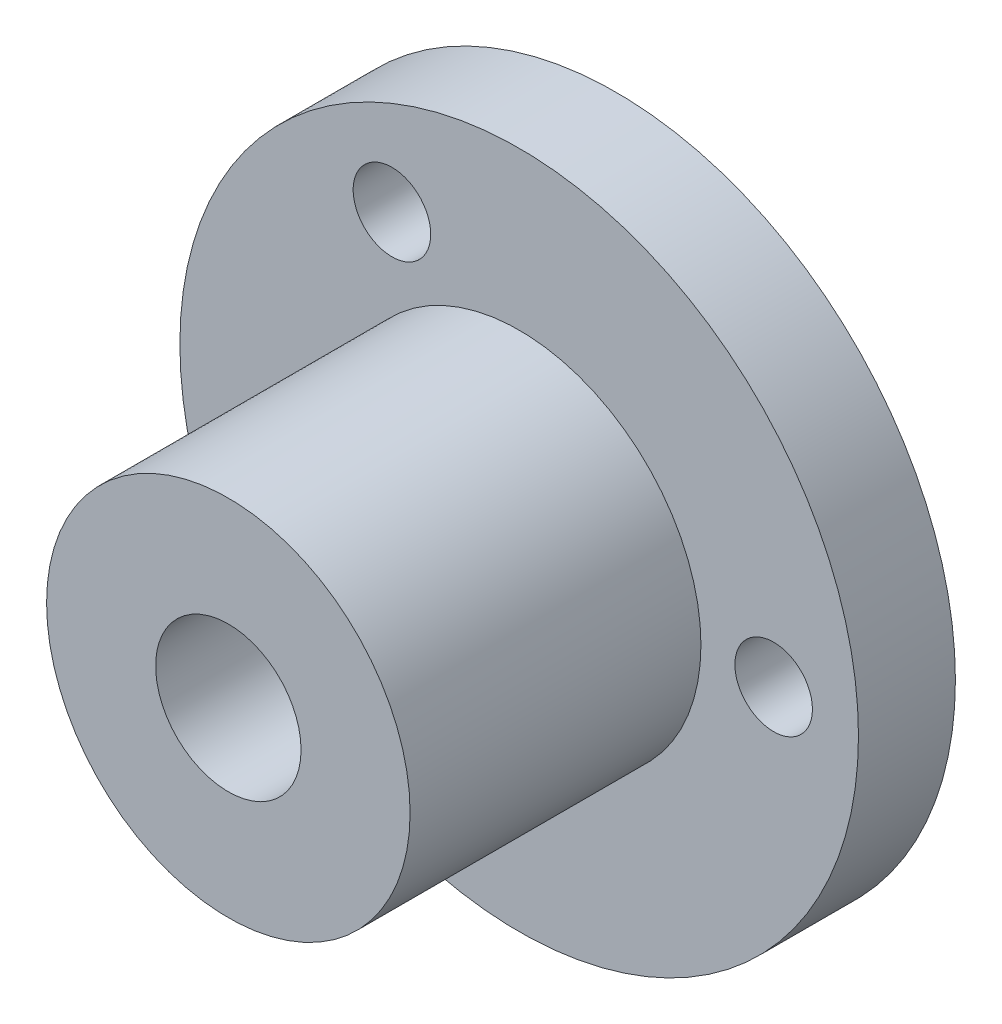
ISO-10303-21;
HEADER;
FILE_DESCRIPTION(('STEP AP214'),'2;1');
FILE_NAME('part.step','',(''),(''),'','','');
FILE_SCHEMA(('AUTOMOTIVE_DESIGN { 1 0 10303 214 1 1 1 1 }'));
ENDSEC;
DATA;
#1=APPLICATION_CONTEXT('core data for automotive mechanical design processes');
#2=APPLICATION_PROTOCOL_DEFINITION('international standard','automotive_design',2000,#1);
#3=PRODUCT_CONTEXT('',#1,'mechanical');
#4=PRODUCT('Part','Part','',(#3));
#5=PRODUCT_RELATED_PRODUCT_CATEGORY('part','',(#4));
#6=PRODUCT_DEFINITION_FORMATION('','',#4);
#7=PRODUCT_DEFINITION_CONTEXT('part definition',#1,'design');
#8=PRODUCT_DEFINITION('design','',#6,#7);
#9=PRODUCT_DEFINITION_SHAPE('','',#8);
#10=(LENGTH_UNIT() NAMED_UNIT(*) SI_UNIT(.MILLI.,.METRE.));
#11=(NAMED_UNIT(*) PLANE_ANGLE_UNIT() SI_UNIT($,.RADIAN.));
#12=(NAMED_UNIT(*) SI_UNIT($,.STERADIAN.) SOLID_ANGLE_UNIT());
#13=UNCERTAINTY_MEASURE_WITH_UNIT(LENGTH_MEASURE(1.E-05),#10,'distance_accuracy_value','');
#14=(GEOMETRIC_REPRESENTATION_CONTEXT(3) GLOBAL_UNCERTAINTY_ASSIGNED_CONTEXT((#13)) GLOBAL_UNIT_ASSIGNED_CONTEXT((#10,
#11,#12)) REPRESENTATION_CONTEXT('',''));
#15=CARTESIAN_POINT('',(0.,0.,0.));
#16=DIRECTION('',(0.,0.,1.));
#17=DIRECTION('',(1.,0.,0.));
#18=AXIS2_PLACEMENT_3D('',#15,#16,#17);
#19=CARTESIAN_POINT('',(0.,0.,4.));
#20=DIRECTION('',(0.,0.,-1.));
#21=DIRECTION('',(-1.,0.,0.));
#22=AXIS2_PLACEMENT_3D('',#19,#20,#21);
#23=CYLINDRICAL_SURFACE('',#22,3.);
#24=CARTESIAN_POINT('',(0.,0.,0.));
#25=DIRECTION('',(0.,0.,1.));
#26=DIRECTION('',(1.,0.,0.));
#27=AXIS2_PLACEMENT_3D('',#24,#25,#26);
#28=CIRCLE('',#27,3.);
#29=CARTESIAN_POINT('',(3.,0.,0.));
#30=VERTEX_POINT('',#29);
#31=EDGE_CURVE('E66',#30,#30,#28,.T.);
#32=ORIENTED_EDGE('',*,*,#31,.F.);
#33=EDGE_LOOP('',(#32));
#34=FACE_BOUND('',#33,.T.);
#35=CARTESIAN_POINT('',(0.,0.,16.));
#36=DIRECTION('',(0.,0.,1.));
#37=DIRECTION('',(1.,0.,0.));
#38=AXIS2_PLACEMENT_3D('',#35,#36,#37);
#39=CIRCLE('',#38,3.);
#40=CARTESIAN_POINT('',(3.,0.,16.));
#41=VERTEX_POINT('',#40);
#42=EDGE_CURVE('E154',#41,#41,#39,.T.);
#43=ORIENTED_EDGE('',*,*,#42,.T.);
#44=EDGE_LOOP('',(#43));
#45=FACE_BOUND('',#44,.T.);
#46=ADVANCED_FACE('F31',(#34,#45),#23,.F.);
#47=CARTESIAN_POINT('',(-5.25000000000004,9.09326673973658,4.));
#48=DIRECTION('',(0.,0.,-1.));
#49=DIRECTION('',(-1.,0.,0.));
#50=AXIS2_PLACEMENT_3D('',#47,#48,#49);
#51=CYLINDRICAL_SURFACE('',#50,1.6);
#52=CARTESIAN_POINT('',(-5.25000000000004,9.09326673973658,4.));
#53=DIRECTION('',(0.,0.,1.));
#54=DIRECTION('',(1.,0.,0.));
#55=AXIS2_PLACEMENT_3D('',#52,#53,#54);
#56=CIRCLE('',#55,1.6);
#57=CARTESIAN_POINT('',(-3.65000000000004,9.09326673973658,4.));
#58=VERTEX_POINT('',#57);
#59=EDGE_CURVE('E44',#58,#58,#56,.T.);
#60=ORIENTED_EDGE('',*,*,#59,.T.);
#61=EDGE_LOOP('',(#60));
#62=FACE_BOUND('',#61,.T.);
#63=CARTESIAN_POINT('',(-5.25000000000004,9.09326673973658,0.));
#64=DIRECTION('',(0.,0.,1.));
#65=DIRECTION('',(1.,0.,0.));
#66=AXIS2_PLACEMENT_3D('',#63,#64,#65);
#67=CIRCLE('',#66,1.6);
#68=CARTESIAN_POINT('',(-3.65000000000004,9.09326673973658,0.));
#69=VERTEX_POINT('',#68);
#70=EDGE_CURVE('E64',#69,#69,#67,.T.);
#71=ORIENTED_EDGE('',*,*,#70,.F.);
#72=EDGE_LOOP('',(#71));
#73=FACE_BOUND('',#72,.T.);
#74=ADVANCED_FACE('F93',(#62,#73),#51,.F.);
#75=CARTESIAN_POINT('',(-5.25000000000004,-9.09326673973658,4.));
#76=DIRECTION('',(0.,0.,-1.));
#77=DIRECTION('',(-1.,0.,0.));
#78=AXIS2_PLACEMENT_3D('',#75,#76,#77);
#79=CYLINDRICAL_SURFACE('',#78,1.6);
#80=CARTESIAN_POINT('',(-5.25000000000004,-9.09326673973658,4.));
#81=DIRECTION('',(0.,0.,1.));
#82=DIRECTION('',(1.,0.,0.));
#83=AXIS2_PLACEMENT_3D('',#80,#81,#82);
#84=CIRCLE('',#83,1.6);
#85=CARTESIAN_POINT('',(-3.65000000000004,-9.09326673973658,4.));
#86=VERTEX_POINT('',#85);
#87=EDGE_CURVE('E53',#86,#86,#84,.T.);
#88=ORIENTED_EDGE('',*,*,#87,.T.);
#89=EDGE_LOOP('',(#88));
#90=FACE_BOUND('',#89,.T.);
#91=CARTESIAN_POINT('',(-5.25000000000004,-9.09326673973658,0.));
#92=DIRECTION('',(0.,0.,1.));
#93=DIRECTION('',(1.,0.,0.));
#94=AXIS2_PLACEMENT_3D('',#91,#92,#93);
#95=CIRCLE('',#94,1.6);
#96=CARTESIAN_POINT('',(-3.65000000000004,-9.09326673973658,0.));
#97=VERTEX_POINT('',#96);
#98=EDGE_CURVE('E61',#97,#97,#95,.T.);
#99=ORIENTED_EDGE('',*,*,#98,.F.);
#100=EDGE_LOOP('',(#99));
#101=FACE_BOUND('',#100,.T.);
#102=ADVANCED_FACE('F99',(#90,#101),#79,.F.);
#103=CARTESIAN_POINT('',(10.5,0.,4.));
#104=DIRECTION('',(0.,0.,-1.));
#105=DIRECTION('',(-1.,0.,0.));
#106=AXIS2_PLACEMENT_3D('',#103,#104,#105);
#107=CYLINDRICAL_SURFACE('',#106,1.6);
#108=CARTESIAN_POINT('',(10.5,0.,4.));
#109=DIRECTION('',(0.,0.,1.));
#110=DIRECTION('',(1.,0.,0.));
#111=AXIS2_PLACEMENT_3D('',#108,#109,#110);
#112=CIRCLE('',#111,1.6);
#113=CARTESIAN_POINT('',(12.1,0.,4.));
#114=VERTEX_POINT('',#113);
#115=EDGE_CURVE('E50',#114,#114,#112,.T.);
#116=ORIENTED_EDGE('',*,*,#115,.T.);
#117=EDGE_LOOP('',(#116));
#118=FACE_BOUND('',#117,.T.);
#119=CARTESIAN_POINT('',(10.5,0.,0.));
#120=DIRECTION('',(0.,0.,1.));
#121=DIRECTION('',(1.,0.,0.));
#122=AXIS2_PLACEMENT_3D('',#119,#120,#121);
#123=CIRCLE('',#122,1.6);
#124=CARTESIAN_POINT('',(12.1,0.,0.));
#125=VERTEX_POINT('',#124);
#126=EDGE_CURVE('E58',#125,#125,#123,.T.);
#127=ORIENTED_EDGE('',*,*,#126,.F.);
#128=EDGE_LOOP('',(#127));
#129=FACE_BOUND('',#128,.T.);
#130=ADVANCED_FACE('F33',(#118,#129),#107,.F.);
#131=CARTESIAN_POINT('',(0.,0.,4.));
#132=DIRECTION('',(0.,0.,-1.));
#133=DIRECTION('',(-1.,0.,0.));
#134=AXIS2_PLACEMENT_3D('',#131,#132,#133);
#135=CYLINDRICAL_SURFACE('',#134,14.);
#136=CARTESIAN_POINT('',(0.,0.,4.));
#137=DIRECTION('',(0.,0.,1.));
#138=DIRECTION('',(1.,0.,0.));
#139=AXIS2_PLACEMENT_3D('',#136,#137,#138);
#140=CIRCLE('',#139,14.);
#141=CARTESIAN_POINT('',(14.,0.,4.));
#142=VERTEX_POINT('',#141);
#143=EDGE_CURVE('E39',#142,#142,#140,.T.);
#144=ORIENTED_EDGE('',*,*,#143,.F.);
#145=EDGE_LOOP('',(#144));
#146=FACE_BOUND('',#145,.T.);
#147=CARTESIAN_POINT('',(0.,0.,0.));
#148=DIRECTION('',(0.,0.,1.));
#149=DIRECTION('',(1.,0.,0.));
#150=AXIS2_PLACEMENT_3D('',#147,#148,#149);
#151=CIRCLE('',#150,14.);
#152=CARTESIAN_POINT('',(14.,0.,0.));
#153=VERTEX_POINT('',#152);
#154=EDGE_CURVE('E35',#153,#153,#151,.T.);
#155=ORIENTED_EDGE('',*,*,#154,.T.);
#156=EDGE_LOOP('',(#155));
#157=FACE_BOUND('',#156,.T.);
#158=ADVANCED_FACE('F73',(#146,#157),#135,.T.);
#159=CARTESIAN_POINT('',(0.,0.,4.));
#160=DIRECTION('',(0.,0.,1.));
#161=DIRECTION('',(1.,0.,0.));
#162=AXIS2_PLACEMENT_3D('',#159,#160,#161);
#163=PLANE('',#162);
#164=CARTESIAN_POINT('',(0.,0.,4.));
#165=DIRECTION('',(0.,0.,1.));
#166=DIRECTION('',(1.,0.,0.));
#167=AXIS2_PLACEMENT_3D('',#164,#165,#166);
#168=CIRCLE('',#167,7.5);
#169=CARTESIAN_POINT('',(7.5,0.,4.));
#170=VERTEX_POINT('',#169);
#171=EDGE_CURVE('E10',#170,#170,#168,.T.);
#172=ORIENTED_EDGE('',*,*,#171,.F.);
#173=EDGE_LOOP('',(#172));
#174=FACE_BOUND('',#173,.T.);
#175=ORIENTED_EDGE('',*,*,#115,.F.);
#176=EDGE_LOOP('',(#175));
#177=FACE_BOUND('',#176,.T.);
#178=ORIENTED_EDGE('',*,*,#87,.F.);
#179=EDGE_LOOP('',(#178));
#180=FACE_BOUND('',#179,.T.);
#181=ORIENTED_EDGE('',*,*,#59,.F.);
#182=EDGE_LOOP('',(#181));
#183=FACE_BOUND('',#182,.T.);
#184=ORIENTED_EDGE('',*,*,#143,.T.);
#185=EDGE_LOOP('',(#184));
#186=FACE_BOUND('',#185,.T.);
#187=ADVANCED_FACE('F78',(#174,#177,#180,#183,#186),#163,.T.);
#188=CARTESIAN_POINT('',(0.,0.,0.));
#189=DIRECTION('',(0.,0.,1.));
#190=DIRECTION('',(1.,0.,0.));
#191=AXIS2_PLACEMENT_3D('',#188,#189,#190);
#192=PLANE('',#191);
#193=ORIENTED_EDGE('',*,*,#126,.T.);
#194=EDGE_LOOP('',(#193));
#195=FACE_BOUND('',#194,.T.);
#196=ORIENTED_EDGE('',*,*,#98,.T.);
#197=EDGE_LOOP('',(#196));
#198=FACE_BOUND('',#197,.T.);
#199=ORIENTED_EDGE('',*,*,#70,.T.);
#200=EDGE_LOOP('',(#199));
#201=FACE_BOUND('',#200,.T.);
#202=ORIENTED_EDGE('',*,*,#31,.T.);
#203=EDGE_LOOP('',(#202));
#204=FACE_BOUND('',#203,.T.);
#205=ORIENTED_EDGE('',*,*,#154,.F.);
#206=EDGE_LOOP('',(#205));
#207=FACE_BOUND('',#206,.T.);
#208=ADVANCED_FACE('F75',(#195,#198,#201,#204,#207),#192,.F.);
#209=CARTESIAN_POINT('',(0.,0.,16.));
#210=DIRECTION('',(0.,0.,1.));
#211=DIRECTION('',(1.,0.,0.));
#212=AXIS2_PLACEMENT_3D('',#209,#210,#211);
#213=PLANE('',#212);
#214=CARTESIAN_POINT('',(0.,0.,16.));
#215=DIRECTION('',(0.,0.,1.));
#216=DIRECTION('',(1.,0.,0.));
#217=AXIS2_PLACEMENT_3D('',#214,#215,#216);
#218=CIRCLE('',#217,7.5);
#219=CARTESIAN_POINT('',(7.5,0.,16.));
#220=VERTEX_POINT('',#219);
#221=EDGE_CURVE('E48',#220,#220,#218,.T.);
#222=ORIENTED_EDGE('',*,*,#221,.T.);
#223=EDGE_LOOP('',(#222));
#224=FACE_BOUND('',#223,.T.);
#225=ORIENTED_EDGE('',*,*,#42,.F.);
#226=EDGE_LOOP('',(#225));
#227=FACE_BOUND('',#226,.T.);
#228=ADVANCED_FACE('F77',(#224,#227),#213,.T.);
#229=CARTESIAN_POINT('',(0.,0.,16.));
#230=DIRECTION('',(0.,0.,-1.));
#231=DIRECTION('',(-1.,0.,0.));
#232=AXIS2_PLACEMENT_3D('',#229,#230,#231);
#233=CYLINDRICAL_SURFACE('',#232,7.5);
#234=ORIENTED_EDGE('',*,*,#221,.F.);
#235=EDGE_LOOP('',(#234));
#236=FACE_BOUND('',#235,.T.);
#237=ORIENTED_EDGE('',*,*,#171,.T.);
#238=EDGE_LOOP('',(#237));
#239=FACE_BOUND('',#238,.T.);
#240=ADVANCED_FACE('F85',(#236,#239),#233,.T.);
#241=CLOSED_SHELL('',(#46,#74,#102,#130,#158,#187,#208,#228,#240));
#242=MANIFOLD_SOLID_BREP('B2',#241);
#243=ADVANCED_BREP_SHAPE_REPRESENTATION('',(#18,#242),#14);
#244=SHAPE_DEFINITION_REPRESENTATION(#9,#243);
ENDSEC;
END-ISO-10303-21;
